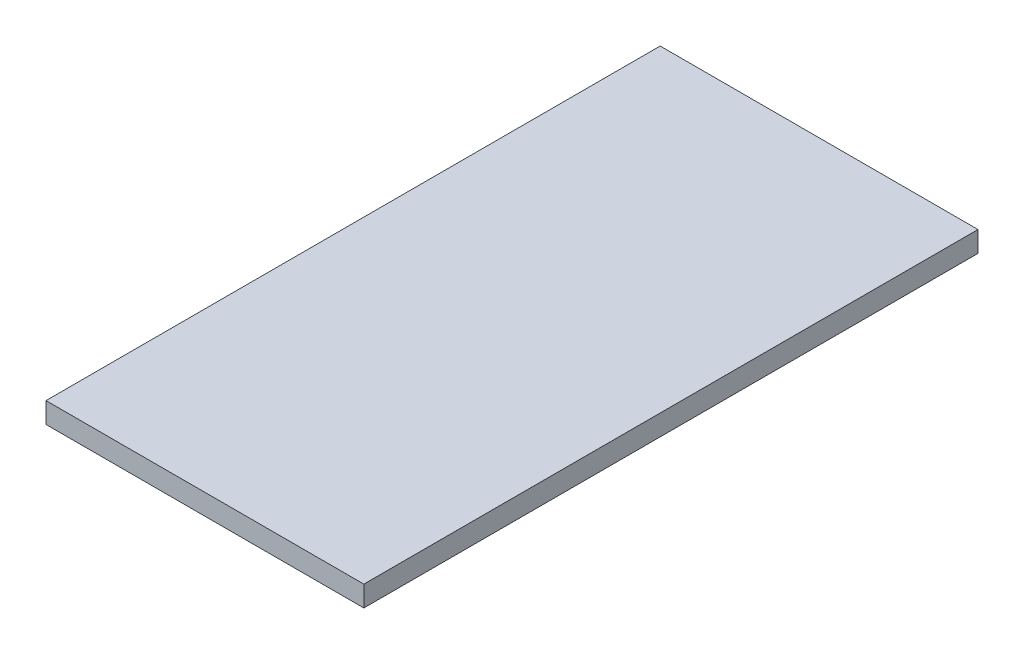
ISO-10303-21;
HEADER;
FILE_DESCRIPTION(('STEP AP214'),'2;1');
FILE_NAME('part.step','',(''),(''),'','','');
FILE_SCHEMA(('AUTOMOTIVE_DESIGN { 1 0 10303 214 1 1 1 1 }'));
ENDSEC;
DATA;
#1=APPLICATION_CONTEXT('core data for automotive mechanical design processes');
#2=APPLICATION_PROTOCOL_DEFINITION('international standard','automotive_design',2000,#1);
#3=PRODUCT_CONTEXT('',#1,'mechanical');
#4=PRODUCT('Part','Part','',(#3));
#5=PRODUCT_RELATED_PRODUCT_CATEGORY('part','',(#4));
#6=PRODUCT_DEFINITION_FORMATION('','',#4);
#7=PRODUCT_DEFINITION_CONTEXT('part definition',#1,'design');
#8=PRODUCT_DEFINITION('design','',#6,#7);
#9=PRODUCT_DEFINITION_SHAPE('','',#8);
#10=(LENGTH_UNIT() NAMED_UNIT(*) SI_UNIT(.MILLI.,.METRE.));
#11=(NAMED_UNIT(*) PLANE_ANGLE_UNIT() SI_UNIT($,.RADIAN.));
#12=(NAMED_UNIT(*) SI_UNIT($,.STERADIAN.) SOLID_ANGLE_UNIT());
#13=UNCERTAINTY_MEASURE_WITH_UNIT(LENGTH_MEASURE(1.E-05),#10,'distance_accuracy_value','');
#14=(GEOMETRIC_REPRESENTATION_CONTEXT(3) GLOBAL_UNCERTAINTY_ASSIGNED_CONTEXT((#13)) GLOBAL_UNIT_ASSIGNED_CONTEXT((#10,
#11,#12)) REPRESENTATION_CONTEXT('',''));
#15=CARTESIAN_POINT('',(0.,0.,0.));
#16=DIRECTION('',(0.,0.,1.));
#17=DIRECTION('',(1.,0.,0.));
#18=AXIS2_PLACEMENT_3D('',#15,#16,#17);
#19=CARTESIAN_POINT('',(0.,6.35,0.));
#20=DIRECTION('',(1.,0.,0.));
#21=DIRECTION('',(0.,0.,-1.));
#22=AXIS2_PLACEMENT_3D('',#19,#20,#21);
#23=PLANE('',#22);
#24=DIRECTION('',(0.,0.,1.));
#25=VECTOR('',#24,1.);
#26=CARTESIAN_POINT('',(0.,0.,0.));
#27=LINE('',#26,#25);
#28=CARTESIAN_POINT('',(0.,0.,-188.468));
#29=VERTEX_POINT('',#28);
#30=CARTESIAN_POINT('',(0.,0.,0.));
#31=VERTEX_POINT('',#30);
#32=EDGE_CURVE('E95',#29,#31,#27,.T.);
#33=ORIENTED_EDGE('',*,*,#32,.T.);
#34=DIRECTION('',(0.,-1.,0.));
#35=VECTOR('',#34,1.);
#36=CARTESIAN_POINT('',(0.,6.35,0.));
#37=LINE('',#36,#35);
#38=CARTESIAN_POINT('',(0.,6.35,0.));
#39=VERTEX_POINT('',#38);
#40=EDGE_CURVE('E11',#39,#31,#37,.T.);
#41=ORIENTED_EDGE('',*,*,#40,.F.);
#42=DIRECTION('',(0.,0.,1.));
#43=VECTOR('',#42,1.);
#44=CARTESIAN_POINT('',(0.,6.35,0.));
#45=LINE('',#44,#43);
#46=CARTESIAN_POINT('',(0.,6.35,-188.468));
#47=VERTEX_POINT('',#46);
#48=EDGE_CURVE('E83',#47,#39,#45,.T.);
#49=ORIENTED_EDGE('',*,*,#48,.F.);
#50=DIRECTION('',(0.,-1.,0.));
#51=VECTOR('',#50,1.);
#52=CARTESIAN_POINT('',(0.,6.35,-188.468));
#53=LINE('',#52,#51);
#54=EDGE_CURVE('E91',#47,#29,#53,.T.);
#55=ORIENTED_EDGE('',*,*,#54,.T.);
#56=EDGE_LOOP('',(#33,#41,#49,#55));
#57=FACE_BOUND('',#56,.T.);
#58=ADVANCED_FACE('F32',(#57),#23,.F.);
#59=CARTESIAN_POINT('',(0.,6.35,0.));
#60=DIRECTION('',(0.,0.,-1.));
#61=DIRECTION('',(-1.,0.,0.));
#62=AXIS2_PLACEMENT_3D('',#59,#60,#61);
#63=PLANE('',#62);
#64=DIRECTION('',(1.,0.,0.));
#65=VECTOR('',#64,1.);
#66=CARTESIAN_POINT('',(0.,0.,0.));
#67=LINE('',#66,#65);
#68=CARTESIAN_POINT('',(97.536,0.,0.));
#69=VERTEX_POINT('',#68);
#70=EDGE_CURVE('E87',#31,#69,#67,.T.);
#71=ORIENTED_EDGE('',*,*,#70,.T.);
#72=DIRECTION('',(0.,-1.,0.));
#73=VECTOR('',#72,1.);
#74=CARTESIAN_POINT('',(97.536,6.35,0.));
#75=LINE('',#74,#73);
#76=CARTESIAN_POINT('',(97.536,6.35,0.));
#77=VERTEX_POINT('',#76);
#78=EDGE_CURVE('E40',#77,#69,#75,.T.);
#79=ORIENTED_EDGE('',*,*,#78,.F.);
#80=DIRECTION('',(1.,0.,0.));
#81=VECTOR('',#80,1.);
#82=CARTESIAN_POINT('',(0.,6.35,0.));
#83=LINE('',#82,#81);
#84=EDGE_CURVE('E78',#39,#77,#83,.T.);
#85=ORIENTED_EDGE('',*,*,#84,.F.);
#86=ORIENTED_EDGE('',*,*,#40,.T.);
#87=EDGE_LOOP('',(#71,#79,#85,#86));
#88=FACE_BOUND('',#87,.T.);
#89=ADVANCED_FACE('F86',(#88),#63,.F.);
#90=CARTESIAN_POINT('',(97.536,6.35,0.));
#91=DIRECTION('',(-1.,0.,0.));
#92=DIRECTION('',(0.,0.,1.));
#93=AXIS2_PLACEMENT_3D('',#90,#91,#92);
#94=PLANE('',#93);
#95=DIRECTION('',(0.,0.,-1.));
#96=VECTOR('',#95,1.);
#97=CARTESIAN_POINT('',(97.536,0.,0.));
#98=LINE('',#97,#96);
#99=CARTESIAN_POINT('',(97.536,0.,-188.468));
#100=VERTEX_POINT('',#99);
#101=EDGE_CURVE('E65',#69,#100,#98,.T.);
#102=ORIENTED_EDGE('',*,*,#101,.T.);
#103=DIRECTION('',(0.,-1.,0.));
#104=VECTOR('',#103,1.);
#105=CARTESIAN_POINT('',(97.536,6.35,-188.468));
#106=LINE('',#105,#104);
#107=CARTESIAN_POINT('',(97.536,6.35,-188.468));
#108=VERTEX_POINT('',#107);
#109=EDGE_CURVE('E88',#108,#100,#106,.T.);
#110=ORIENTED_EDGE('',*,*,#109,.F.);
#111=DIRECTION('',(0.,0.,-1.));
#112=VECTOR('',#111,1.);
#113=CARTESIAN_POINT('',(97.536,6.35,0.));
#114=LINE('',#113,#112);
#115=EDGE_CURVE('E81',#77,#108,#114,.T.);
#116=ORIENTED_EDGE('',*,*,#115,.F.);
#117=ORIENTED_EDGE('',*,*,#78,.T.);
#118=EDGE_LOOP('',(#102,#110,#116,#117));
#119=FACE_BOUND('',#118,.T.);
#120=ADVANCED_FACE('F89',(#119),#94,.F.);
#121=CARTESIAN_POINT('',(0.,6.35,-188.468));
#122=DIRECTION('',(0.,0.,1.));
#123=DIRECTION('',(1.,0.,0.));
#124=AXIS2_PLACEMENT_3D('',#121,#122,#123);
#125=PLANE('',#124);
#126=DIRECTION('',(-1.,0.,0.));
#127=VECTOR('',#126,1.);
#128=CARTESIAN_POINT('',(0.,0.,-188.468));
#129=LINE('',#128,#127);
#130=EDGE_CURVE('E71',#100,#29,#129,.T.);
#131=ORIENTED_EDGE('',*,*,#130,.T.);
#132=ORIENTED_EDGE('',*,*,#54,.F.);
#133=DIRECTION('',(-1.,0.,0.));
#134=VECTOR('',#133,1.);
#135=CARTESIAN_POINT('',(0.,6.35,-188.468));
#136=LINE('',#135,#134);
#137=EDGE_CURVE('E48',#108,#47,#136,.T.);
#138=ORIENTED_EDGE('',*,*,#137,.F.);
#139=ORIENTED_EDGE('',*,*,#109,.T.);
#140=EDGE_LOOP('',(#131,#132,#138,#139));
#141=FACE_BOUND('',#140,.T.);
#142=ADVANCED_FACE('F102',(#141),#125,.F.);
#143=CARTESIAN_POINT('',(0.,6.35,0.));
#144=DIRECTION('',(0.,-1.,0.));
#145=DIRECTION('',(0.,0.,-1.));
#146=AXIS2_PLACEMENT_3D('',#143,#144,#145);
#147=PLANE('',#146);
#148=ORIENTED_EDGE('',*,*,#48,.T.);
#149=ORIENTED_EDGE('',*,*,#84,.T.);
#150=ORIENTED_EDGE('',*,*,#115,.T.);
#151=ORIENTED_EDGE('',*,*,#137,.T.);
#152=EDGE_LOOP('',(#148,#149,#150,#151));
#153=FACE_BOUND('',#152,.T.);
#154=ADVANCED_FACE('F79',(#153),#147,.F.);
#155=CARTESIAN_POINT('',(0.,0.,0.));
#156=DIRECTION('',(0.,-1.,0.));
#157=DIRECTION('',(0.,0.,-1.));
#158=AXIS2_PLACEMENT_3D('',#155,#156,#157);
#159=PLANE('',#158);
#160=ORIENTED_EDGE('',*,*,#32,.F.);
#161=ORIENTED_EDGE('',*,*,#130,.F.);
#162=ORIENTED_EDGE('',*,*,#101,.F.);
#163=ORIENTED_EDGE('',*,*,#70,.F.);
#164=EDGE_LOOP('',(#160,#161,#162,#163));
#165=FACE_BOUND('',#164,.T.);
#166=ADVANCED_FACE('F105',(#165),#159,.T.);
#167=CLOSED_SHELL('',(#58,#89,#120,#142,#154,#166));
#168=MANIFOLD_SOLID_BREP('B2',#167);
#169=ADVANCED_BREP_SHAPE_REPRESENTATION('',(#18,#168),#14);
#170=SHAPE_DEFINITION_REPRESENTATION(#9,#169);
ENDSEC;
END-ISO-10303-21;
